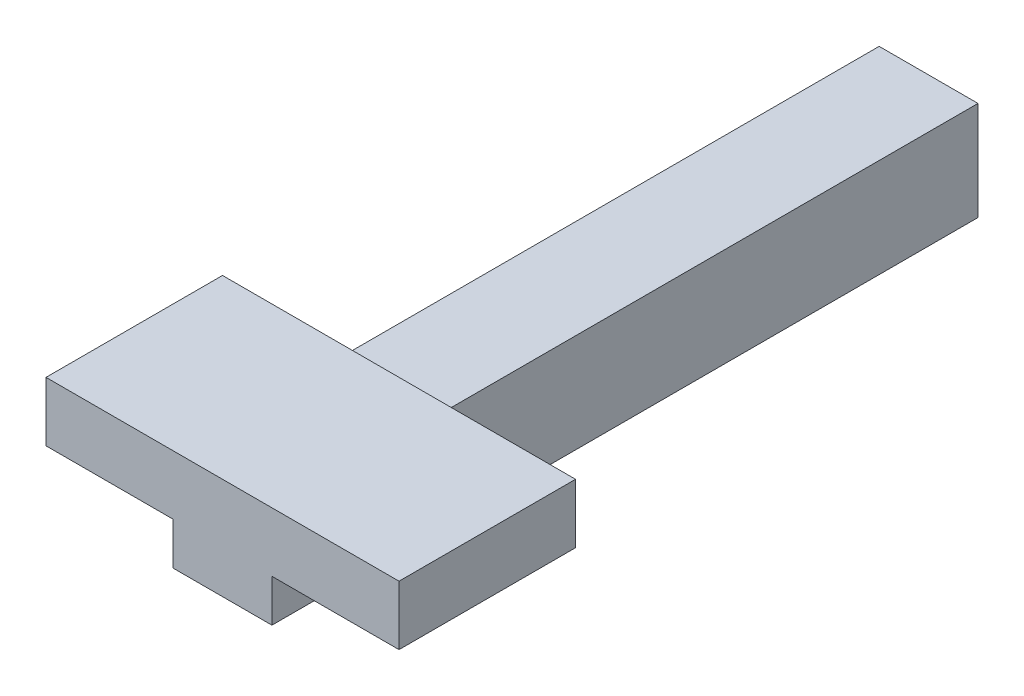
ISO-10303-21;
HEADER;
FILE_DESCRIPTION(('STEP AP214'),'2;1');
FILE_NAME('part.step','',(''),(''),'','','');
FILE_SCHEMA(('AUTOMOTIVE_DESIGN { 1 0 10303 214 1 1 1 1 }'));
ENDSEC;
DATA;
#1=APPLICATION_CONTEXT('core data for automotive mechanical design processes');
#2=APPLICATION_PROTOCOL_DEFINITION('international standard','automotive_design',2000,#1);
#3=PRODUCT_CONTEXT('',#1,'mechanical');
#4=PRODUCT('Part','Part','',(#3));
#5=PRODUCT_RELATED_PRODUCT_CATEGORY('part','',(#4));
#6=PRODUCT_DEFINITION_FORMATION('','',#4);
#7=PRODUCT_DEFINITION_CONTEXT('part definition',#1,'design');
#8=PRODUCT_DEFINITION('design','',#6,#7);
#9=PRODUCT_DEFINITION_SHAPE('','',#8);
#10=(LENGTH_UNIT() NAMED_UNIT(*) SI_UNIT(.MILLI.,.METRE.));
#11=(NAMED_UNIT(*) PLANE_ANGLE_UNIT() SI_UNIT($,.RADIAN.));
#12=(NAMED_UNIT(*) SI_UNIT($,.STERADIAN.) SOLID_ANGLE_UNIT());
#13=UNCERTAINTY_MEASURE_WITH_UNIT(LENGTH_MEASURE(1.E-05),#10,'distance_accuracy_value','');
#14=(GEOMETRIC_REPRESENTATION_CONTEXT(3) GLOBAL_UNCERTAINTY_ASSIGNED_CONTEXT((#13)) GLOBAL_UNIT_ASSIGNED_CONTEXT((#10,
#11,#12)) REPRESENTATION_CONTEXT('',''));
#15=CARTESIAN_POINT('',(0.,0.,0.));
#16=DIRECTION('',(0.,0.,1.));
#17=DIRECTION('',(1.,0.,0.));
#18=AXIS2_PLACEMENT_3D('',#15,#16,#17);
#19=CARTESIAN_POINT('',(-35.,35.,500.));
#20=DIRECTION('',(1.,0.,0.));
#21=DIRECTION('',(0.,1.,0.));
#22=AXIS2_PLACEMENT_3D('',#19,#20,#21);
#23=PLANE('',#22);
#24=DIRECTION('',(0.,-1.,0.));
#25=VECTOR('',#24,1.);
#26=CARTESIAN_POINT('',(-35.,35.,375.));
#27=LINE('',#26,#25);
#28=CARTESIAN_POINT('',(-35.,35.,375.));
#29=VERTEX_POINT('',#28);
#30=CARTESIAN_POINT('',(-35.,-5.,375.));
#31=VERTEX_POINT('',#30);
#32=EDGE_CURVE('E79',#29,#31,#27,.T.);
#33=ORIENTED_EDGE('',*,*,#32,.F.);
#34=DIRECTION('',(0.,0.,-1.));
#35=VECTOR('',#34,1.);
#36=CARTESIAN_POINT('',(-35.,35.,500.));
#37=LINE('',#36,#35);
#38=CARTESIAN_POINT('',(-35.,35.,0.));
#39=VERTEX_POINT('',#38);
#40=EDGE_CURVE('E73',#29,#39,#37,.T.);
#41=ORIENTED_EDGE('',*,*,#40,.T.);
#42=DIRECTION('',(0.,-1.,0.));
#43=VECTOR('',#42,1.);
#44=CARTESIAN_POINT('',(-35.,35.,0.));
#45=LINE('',#44,#43);
#46=CARTESIAN_POINT('',(-35.,-35.,0.));
#47=VERTEX_POINT('',#46);
#48=EDGE_CURVE('E76',#39,#47,#45,.T.);
#49=ORIENTED_EDGE('',*,*,#48,.T.);
#50=DIRECTION('',(0.,0.,-1.));
#51=VECTOR('',#50,1.);
#52=CARTESIAN_POINT('',(-35.,-35.,500.));
#53=LINE('',#52,#51);
#54=CARTESIAN_POINT('',(-35.,-35.,500.));
#55=VERTEX_POINT('',#54);
#56=EDGE_CURVE('E41',#55,#47,#53,.T.);
#57=ORIENTED_EDGE('',*,*,#56,.F.);
#58=DIRECTION('',(0.,-1.,0.));
#59=VECTOR('',#58,1.);
#60=CARTESIAN_POINT('',(-35.,35.,500.));
#61=LINE('',#60,#59);
#62=CARTESIAN_POINT('',(-35.,-5.,500.));
#63=VERTEX_POINT('',#62);
#64=EDGE_CURVE('E87',#63,#55,#61,.T.);
#65=ORIENTED_EDGE('',*,*,#64,.F.);
#66=DIRECTION('',(0.,0.,-1.));
#67=VECTOR('',#66,1.);
#68=CARTESIAN_POINT('',(-35.,-5.,500.));
#69=LINE('',#68,#67);
#70=EDGE_CURVE('E110',#63,#31,#69,.T.);
#71=ORIENTED_EDGE('',*,*,#70,.T.);
#72=EDGE_LOOP('',(#33,#41,#49,#57,#65,#71));
#73=FACE_BOUND('',#72,.T.);
#74=ADVANCED_FACE('F33',(#73),#23,.F.);
#75=CARTESIAN_POINT('',(35.,35.,500.));
#76=DIRECTION('',(-1.,0.,0.));
#77=DIRECTION('',(0.,-1.,0.));
#78=AXIS2_PLACEMENT_3D('',#75,#76,#77);
#79=PLANE('',#78);
#80=DIRECTION('',(0.,1.,0.));
#81=VECTOR('',#80,1.);
#82=CARTESIAN_POINT('',(35.,35.,375.));
#83=LINE('',#82,#81);
#84=CARTESIAN_POINT('',(35.,-4.99999999999999,375.));
#85=VERTEX_POINT('',#84);
#86=CARTESIAN_POINT('',(35.,35.,375.));
#87=VERTEX_POINT('',#86);
#88=EDGE_CURVE('E95',#85,#87,#83,.T.);
#89=ORIENTED_EDGE('',*,*,#88,.F.);
#90=DIRECTION('',(0.,0.,1.));
#91=VECTOR('',#90,1.);
#92=CARTESIAN_POINT('',(35.,-4.99999999999999,500.));
#93=LINE('',#92,#91);
#94=CARTESIAN_POINT('',(35.,-4.99999999999999,500.));
#95=VERTEX_POINT('',#94);
#96=EDGE_CURVE('E120',#85,#95,#93,.T.);
#97=ORIENTED_EDGE('',*,*,#96,.T.);
#98=DIRECTION('',(0.,1.,0.));
#99=VECTOR('',#98,1.);
#100=CARTESIAN_POINT('',(35.,35.,500.));
#101=LINE('',#100,#99);
#102=CARTESIAN_POINT('',(35.,-35.,500.));
#103=VERTEX_POINT('',#102);
#104=EDGE_CURVE('E80',#103,#95,#101,.T.);
#105=ORIENTED_EDGE('',*,*,#104,.F.);
#106=DIRECTION('',(0.,0.,-1.));
#107=VECTOR('',#106,1.);
#108=CARTESIAN_POINT('',(35.,-35.,500.));
#109=LINE('',#108,#107);
#110=CARTESIAN_POINT('',(35.,-35.,0.));
#111=VERTEX_POINT('',#110);
#112=EDGE_CURVE('E102',#103,#111,#109,.T.);
#113=ORIENTED_EDGE('',*,*,#112,.T.);
#114=DIRECTION('',(0.,1.,0.));
#115=VECTOR('',#114,1.);
#116=CARTESIAN_POINT('',(35.,35.,0.));
#117=LINE('',#116,#115);
#118=CARTESIAN_POINT('',(35.,35.,0.));
#119=VERTEX_POINT('',#118);
#120=EDGE_CURVE('E88',#111,#119,#117,.T.);
#121=ORIENTED_EDGE('',*,*,#120,.T.);
#122=DIRECTION('',(0.,0.,-1.));
#123=VECTOR('',#122,1.);
#124=CARTESIAN_POINT('',(35.,35.,500.));
#125=LINE('',#124,#123);
#126=EDGE_CURVE('E66',#87,#119,#125,.T.);
#127=ORIENTED_EDGE('',*,*,#126,.F.);
#128=EDGE_LOOP('',(#89,#97,#105,#113,#121,#127));
#129=FACE_BOUND('',#128,.T.);
#130=ADVANCED_FACE('F203',(#129),#79,.F.);
#131=CARTESIAN_POINT('',(35.,35.,500.));
#132=DIRECTION('',(0.,-1.,0.));
#133=DIRECTION('',(1.,0.,0.));
#134=AXIS2_PLACEMENT_3D('',#131,#132,#133);
#135=PLANE('',#134);
#136=DIRECTION('',(-1.,0.,0.));
#137=VECTOR('',#136,1.);
#138=CARTESIAN_POINT('',(35.,35.,375.));
#139=LINE('',#138,#137);
#140=EDGE_CURVE('E11',#87,#29,#139,.T.);
#141=ORIENTED_EDGE('',*,*,#140,.F.);
#142=ORIENTED_EDGE('',*,*,#126,.T.);
#143=DIRECTION('',(-1.,0.,0.));
#144=VECTOR('',#143,1.);
#145=CARTESIAN_POINT('',(35.,35.,0.));
#146=LINE('',#145,#144);
#147=EDGE_CURVE('E83',#119,#39,#146,.T.);
#148=ORIENTED_EDGE('',*,*,#147,.T.);
#149=ORIENTED_EDGE('',*,*,#40,.F.);
#150=EDGE_LOOP('',(#141,#142,#148,#149));
#151=FACE_BOUND('',#150,.T.);
#152=ADVANCED_FACE('F84',(#151),#135,.F.);
#153=CARTESIAN_POINT('',(35.,-35.,500.));
#154=DIRECTION('',(0.,1.,0.));
#155=DIRECTION('',(0.,0.,1.));
#156=AXIS2_PLACEMENT_3D('',#153,#154,#155);
#157=PLANE('',#156);
#158=DIRECTION('',(1.,0.,0.));
#159=VECTOR('',#158,1.);
#160=CARTESIAN_POINT('',(35.,-35.,0.));
#161=LINE('',#160,#159);
#162=EDGE_CURVE('E91',#47,#111,#161,.T.);
#163=ORIENTED_EDGE('',*,*,#162,.T.);
#164=ORIENTED_EDGE('',*,*,#112,.F.);
#165=DIRECTION('',(1.,0.,0.));
#166=VECTOR('',#165,1.);
#167=CARTESIAN_POINT('',(35.,-35.,500.));
#168=LINE('',#167,#166);
#169=EDGE_CURVE('E49',#55,#103,#168,.T.);
#170=ORIENTED_EDGE('',*,*,#169,.F.);
#171=ORIENTED_EDGE('',*,*,#56,.T.);
#172=EDGE_LOOP('',(#163,#164,#170,#171));
#173=FACE_BOUND('',#172,.T.);
#174=ADVANCED_FACE('F105',(#173),#157,.F.);
#175=CARTESIAN_POINT('',(0.,0.,500.));
#176=DIRECTION('',(0.,0.,-1.));
#177=DIRECTION('',(-1.,0.,0.));
#178=AXIS2_PLACEMENT_3D('',#175,#176,#177);
#179=PLANE('',#178);
#180=DIRECTION('',(1.,0.,0.));
#181=VECTOR('',#180,1.);
#182=CARTESIAN_POINT('',(-125.,-5.00000000000001,500.));
#183=LINE('',#182,#181);
#184=CARTESIAN_POINT('',(-125.,-5.00000000000001,500.));
#185=VERTEX_POINT('',#184);
#186=EDGE_CURVE('E147',#185,#63,#183,.T.);
#187=ORIENTED_EDGE('',*,*,#186,.T.);
#188=ORIENTED_EDGE('',*,*,#64,.T.);
#189=ORIENTED_EDGE('',*,*,#169,.T.);
#190=ORIENTED_EDGE('',*,*,#104,.T.);
#191=CARTESIAN_POINT('',(125.,-4.99999999999998,500.));
#192=VERTEX_POINT('',#191);
#193=EDGE_CURVE('E149',#95,#192,#183,.T.);
#194=ORIENTED_EDGE('',*,*,#193,.T.);
#195=DIRECTION('',(0.,-1.,0.));
#196=VECTOR('',#195,1.);
#197=CARTESIAN_POINT('',(125.,37.,500.));
#198=LINE('',#197,#196);
#199=CARTESIAN_POINT('',(125.,37.,500.));
#200=VERTEX_POINT('',#199);
#201=EDGE_CURVE('E132',#200,#192,#198,.T.);
#202=ORIENTED_EDGE('',*,*,#201,.F.);
#203=DIRECTION('',(1.,0.,0.));
#204=VECTOR('',#203,1.);
#205=CARTESIAN_POINT('',(-125.,37.,500.));
#206=LINE('',#205,#204);
#207=CARTESIAN_POINT('',(-125.,37.,500.));
#208=VERTEX_POINT('',#207);
#209=EDGE_CURVE('E135',#208,#200,#206,.T.);
#210=ORIENTED_EDGE('',*,*,#209,.F.);
#211=DIRECTION('',(0.,-1.,0.));
#212=VECTOR('',#211,1.);
#213=CARTESIAN_POINT('',(-125.,37.,500.));
#214=LINE('',#213,#212);
#215=EDGE_CURVE('E129',#208,#185,#214,.T.);
#216=ORIENTED_EDGE('',*,*,#215,.T.);
#217=EDGE_LOOP('',(#187,#188,#189,#190,#194,#202,#210,#216));
#218=FACE_BOUND('',#217,.T.);
#219=ADVANCED_FACE('F183',(#218),#179,.F.);
#220=CARTESIAN_POINT('',(0.,0.,0.));
#221=DIRECTION('',(0.,0.,-1.));
#222=DIRECTION('',(-1.,0.,0.));
#223=AXIS2_PLACEMENT_3D('',#220,#221,#222);
#224=PLANE('',#223);
#225=ORIENTED_EDGE('',*,*,#48,.F.);
#226=ORIENTED_EDGE('',*,*,#147,.F.);
#227=ORIENTED_EDGE('',*,*,#120,.F.);
#228=ORIENTED_EDGE('',*,*,#162,.F.);
#229=EDGE_LOOP('',(#225,#226,#227,#228));
#230=FACE_BOUND('',#229,.T.);
#231=ADVANCED_FACE('F90',(#230),#224,.T.);
#232=CARTESIAN_POINT('',(-125.,37.,375.));
#233=DIRECTION('',(0.,0.,1.));
#234=DIRECTION('',(1.,0.,0.));
#235=AXIS2_PLACEMENT_3D('',#232,#233,#234);
#236=PLANE('',#235);
#237=ORIENTED_EDGE('',*,*,#140,.T.);
#238=ORIENTED_EDGE('',*,*,#32,.T.);
#239=DIRECTION('',(-1.,0.,0.));
#240=VECTOR('',#239,1.);
#241=CARTESIAN_POINT('',(-125.,-5.00000000000001,375.));
#242=LINE('',#241,#240);
#243=CARTESIAN_POINT('',(-125.,-5.00000000000001,375.));
#244=VERTEX_POINT('',#243);
#245=EDGE_CURVE('E156',#31,#244,#242,.T.);
#246=ORIENTED_EDGE('',*,*,#245,.T.);
#247=DIRECTION('',(0.,-1.,0.));
#248=VECTOR('',#247,1.);
#249=CARTESIAN_POINT('',(-125.,37.,375.));
#250=LINE('',#249,#248);
#251=CARTESIAN_POINT('',(-125.,37.,375.));
#252=VERTEX_POINT('',#251);
#253=EDGE_CURVE('E126',#252,#244,#250,.T.);
#254=ORIENTED_EDGE('',*,*,#253,.F.);
#255=DIRECTION('',(-1.,0.,0.));
#256=VECTOR('',#255,1.);
#257=CARTESIAN_POINT('',(-125.,37.,375.));
#258=LINE('',#257,#256);
#259=CARTESIAN_POINT('',(125.,37.,375.));
#260=VERTEX_POINT('',#259);
#261=EDGE_CURVE('E141',#260,#252,#258,.T.);
#262=ORIENTED_EDGE('',*,*,#261,.F.);
#263=DIRECTION('',(0.,-1.,0.));
#264=VECTOR('',#263,1.);
#265=CARTESIAN_POINT('',(125.,37.,375.));
#266=LINE('',#265,#264);
#267=CARTESIAN_POINT('',(125.,-4.99999999999998,375.));
#268=VERTEX_POINT('',#267);
#269=EDGE_CURVE('E123',#260,#268,#266,.T.);
#270=ORIENTED_EDGE('',*,*,#269,.T.);
#271=EDGE_CURVE('E153',#268,#85,#242,.T.);
#272=ORIENTED_EDGE('',*,*,#271,.T.);
#273=ORIENTED_EDGE('',*,*,#88,.T.);
#274=EDGE_LOOP('',(#237,#238,#246,#254,#262,#270,#272,#273));
#275=FACE_BOUND('',#274,.T.);
#276=ADVANCED_FACE('F168',(#275),#236,.F.);
#277=CARTESIAN_POINT('',(0.,-5.,0.));
#278=DIRECTION('',(0.,-1.,0.));
#279=DIRECTION('',(1.,0.,0.));
#280=AXIS2_PLACEMENT_3D('',#277,#278,#279);
#281=PLANE('',#280);
#282=ORIENTED_EDGE('',*,*,#70,.F.);
#283=ORIENTED_EDGE('',*,*,#186,.F.);
#284=DIRECTION('',(0.,0.,1.));
#285=VECTOR('',#284,1.);
#286=CARTESIAN_POINT('',(-125.,-5.00000000000001,500.));
#287=LINE('',#286,#285);
#288=EDGE_CURVE('E150',#244,#185,#287,.T.);
#289=ORIENTED_EDGE('',*,*,#288,.F.);
#290=ORIENTED_EDGE('',*,*,#245,.F.);
#291=EDGE_LOOP('',(#282,#283,#289,#290));
#292=FACE_BOUND('',#291,.T.);
#293=ADVANCED_FACE('F180',(#292),#281,.T.);
#294=ORIENTED_EDGE('',*,*,#96,.F.);
#295=ORIENTED_EDGE('',*,*,#271,.F.);
#296=DIRECTION('',(0.,0.,-1.));
#297=VECTOR('',#296,1.);
#298=CARTESIAN_POINT('',(125.,-4.99999999999998,500.));
#299=LINE('',#298,#297);
#300=EDGE_CURVE('E157',#192,#268,#299,.T.);
#301=ORIENTED_EDGE('',*,*,#300,.F.);
#302=ORIENTED_EDGE('',*,*,#193,.F.);
#303=EDGE_LOOP('',(#294,#295,#301,#302));
#304=FACE_BOUND('',#303,.T.);
#305=ADVANCED_FACE('F211',(#304),#281,.T.);
#306=CARTESIAN_POINT('',(125.,37.,500.));
#307=DIRECTION('',(-1.,0.,0.));
#308=DIRECTION('',(0.,-1.,0.));
#309=AXIS2_PLACEMENT_3D('',#306,#307,#308);
#310=PLANE('',#309);
#311=ORIENTED_EDGE('',*,*,#201,.T.);
#312=ORIENTED_EDGE('',*,*,#300,.T.);
#313=ORIENTED_EDGE('',*,*,#269,.F.);
#314=DIRECTION('',(0.,0.,-1.));
#315=VECTOR('',#314,1.);
#316=CARTESIAN_POINT('',(125.,37.,500.));
#317=LINE('',#316,#315);
#318=EDGE_CURVE('E144',#200,#260,#317,.T.);
#319=ORIENTED_EDGE('',*,*,#318,.F.);
#320=EDGE_LOOP('',(#311,#312,#313,#319));
#321=FACE_BOUND('',#320,.T.);
#322=ADVANCED_FACE('F209',(#321),#310,.F.);
#323=CARTESIAN_POINT('',(-125.,37.,500.));
#324=DIRECTION('',(1.,0.,0.));
#325=DIRECTION('',(0.,1.,0.));
#326=AXIS2_PLACEMENT_3D('',#323,#324,#325);
#327=PLANE('',#326);
#328=ORIENTED_EDGE('',*,*,#253,.T.);
#329=ORIENTED_EDGE('',*,*,#288,.T.);
#330=ORIENTED_EDGE('',*,*,#215,.F.);
#331=DIRECTION('',(0.,0.,1.));
#332=VECTOR('',#331,1.);
#333=CARTESIAN_POINT('',(-125.,37.,500.));
#334=LINE('',#333,#332);
#335=EDGE_CURVE('E138',#252,#208,#334,.T.);
#336=ORIENTED_EDGE('',*,*,#335,.F.);
#337=EDGE_LOOP('',(#328,#329,#330,#336));
#338=FACE_BOUND('',#337,.T.);
#339=ADVANCED_FACE('F177',(#338),#327,.F.);
#340=CARTESIAN_POINT('',(0.,37.,0.));
#341=DIRECTION('',(0.,-1.,0.));
#342=DIRECTION('',(1.,0.,0.));
#343=AXIS2_PLACEMENT_3D('',#340,#341,#342);
#344=PLANE('',#343);
#345=ORIENTED_EDGE('',*,*,#318,.T.);
#346=ORIENTED_EDGE('',*,*,#261,.T.);
#347=ORIENTED_EDGE('',*,*,#335,.T.);
#348=ORIENTED_EDGE('',*,*,#209,.T.);
#349=EDGE_LOOP('',(#345,#346,#347,#348));
#350=FACE_BOUND('',#349,.T.);
#351=ADVANCED_FACE('F213',(#350),#344,.F.);
#352=CLOSED_SHELL('',(#74,#130,#152,#174,#219,#231,#276,#293,#305,#322,#339,#351));
#353=MANIFOLD_SOLID_BREP('B2',#352);
#354=ADVANCED_BREP_SHAPE_REPRESENTATION('',(#18,#353),#14);
#355=SHAPE_DEFINITION_REPRESENTATION(#9,#354);
ENDSEC;
END-ISO-10303-21;
